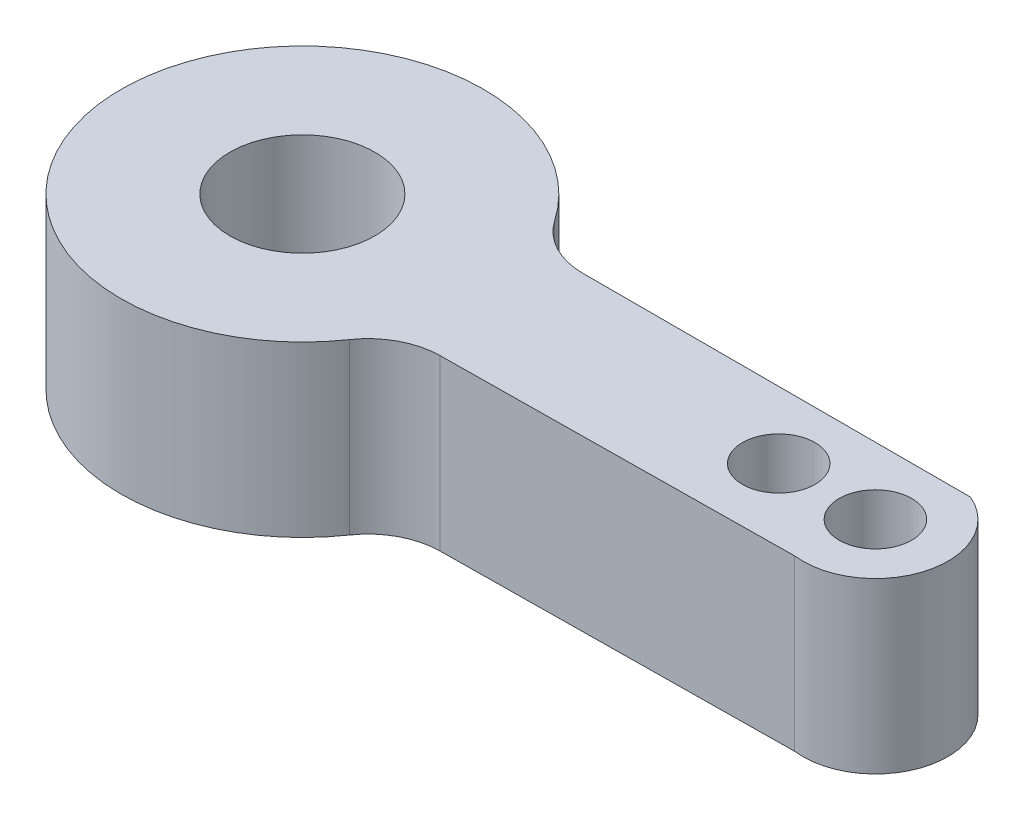
ISO-10303-21;
HEADER;
FILE_DESCRIPTION(('STEP AP214'),'2;1');
FILE_NAME('part.step','',(''),(''),'','','');
FILE_SCHEMA(('AUTOMOTIVE_DESIGN { 1 0 10303 214 1 1 1 1 }'));
ENDSEC;
DATA;
#1=APPLICATION_CONTEXT('core data for automotive mechanical design processes');
#2=APPLICATION_PROTOCOL_DEFINITION('international standard','automotive_design',2000,#1);
#3=PRODUCT_CONTEXT('',#1,'mechanical');
#4=PRODUCT('Part','Part','',(#3));
#5=PRODUCT_RELATED_PRODUCT_CATEGORY('part','',(#4));
#6=PRODUCT_DEFINITION_FORMATION('','',#4);
#7=PRODUCT_DEFINITION_CONTEXT('part definition',#1,'design');
#8=PRODUCT_DEFINITION('design','',#6,#7);
#9=PRODUCT_DEFINITION_SHAPE('','',#8);
#10=(LENGTH_UNIT() NAMED_UNIT(*) SI_UNIT(.MILLI.,.METRE.));
#11=(NAMED_UNIT(*) PLANE_ANGLE_UNIT() SI_UNIT($,.RADIAN.));
#12=(NAMED_UNIT(*) SI_UNIT($,.STERADIAN.) SOLID_ANGLE_UNIT());
#13=UNCERTAINTY_MEASURE_WITH_UNIT(LENGTH_MEASURE(1.E-05),#10,'distance_accuracy_value','');
#14=(GEOMETRIC_REPRESENTATION_CONTEXT(3) GLOBAL_UNCERTAINTY_ASSIGNED_CONTEXT((#13)) GLOBAL_UNIT_ASSIGNED_CONTEXT((#10,
#11,#12)) REPRESENTATION_CONTEXT('',''));
#15=CARTESIAN_POINT('',(0.,0.,0.));
#16=DIRECTION('',(0.,0.,1.));
#17=DIRECTION('',(1.,0.,0.));
#18=AXIS2_PLACEMENT_3D('',#15,#16,#17);
#19=CARTESIAN_POINT('',(0.,7.,0.));
#20=DIRECTION('',(0.,-1.,0.));
#21=DIRECTION('',(0.,0.,-1.));
#22=AXIS2_PLACEMENT_3D('',#19,#20,#21);
#23=PLANE('',#22);
#24=DIRECTION('',(-1.,0.,0.));
#25=VECTOR('',#24,1.);
#26=CARTESIAN_POINT('',(6.89102231975947,7.,-2.96037352180037));
#27=LINE('',#26,#25);
#28=CARTESIAN_POINT('',(24.6694144597538,7.,-2.96037352180037));
#29=VERTEX_POINT('',#28);
#30=CARTESIAN_POINT('',(8.64430144549697,7.,-2.96037352180037));
#31=VERTEX_POINT('',#30);
#32=EDGE_CURVE('E114',#29,#31,#27,.T.);
#33=ORIENTED_EDGE('',*,*,#32,.T.);
#34=CARTESIAN_POINT('',(8.64430144549697,7.,-5.96037352180037));
#35=DIRECTION('',(0.,-1.,0.));
#36=DIRECTION('',(0.,0.,-1.));
#37=AXIS2_PLACEMENT_3D('',#34,#35,#36);
#38=CIRCLE('',#37,3.);
#39=CARTESIAN_POINT('',(6.17450103249783,7.,-4.25740965842883));
#40=VERTEX_POINT('',#39);
#41=EDGE_CURVE('E11',#31,#40,#38,.T.);
#42=ORIENTED_EDGE('',*,*,#41,.T.);
#43=CARTESIAN_POINT('',(0.,7.,0.));
#44=DIRECTION('',(0.,1.,0.));
#45=DIRECTION('',(0.,0.,-1.));
#46=AXIS2_PLACEMENT_3D('',#43,#44,#45);
#47=CIRCLE('',#46,7.49999999999999);
#48=CARTESIAN_POINT('',(6.18399734642069,7.,4.24360422512064));
#49=VERTEX_POINT('',#48);
#50=EDGE_CURVE('E100',#40,#49,#47,.T.);
#51=ORIENTED_EDGE('',*,*,#50,.T.);
#52=CARTESIAN_POINT('',(8.65759628498897,7.,5.9410459151689));
#53=DIRECTION('',(0.,-1.,0.));
#54=DIRECTION('',(0.,0.,-1.));
#55=AXIS2_PLACEMENT_3D('',#52,#53,#54);
#56=CIRCLE('',#55,3.);
#57=CARTESIAN_POINT('',(8.62446541754517,7.,2.94122886314349));
#58=VERTEX_POINT('',#57);
#59=EDGE_CURVE('E96',#49,#58,#56,.T.);
#60=ORIENTED_EDGE('',*,*,#59,.T.);
#61=DIRECTION('',(0.999939017341803,0.,-0.0110436224812638));
#62=VECTOR('',#61,1.);
#63=CARTESIAN_POINT('',(6.89102231975947,7.,2.96037352180037));
#64=LINE('',#63,#62);
#65=CARTESIAN_POINT('',(23.1420853546382,7.,2.78089197146191));
#66=VERTEX_POINT('',#65);
#67=EDGE_CURVE('E88',#58,#66,#64,.T.);
#68=ORIENTED_EDGE('',*,*,#67,.T.);
#69=CARTESIAN_POINT('',(23.5,7.,-0.197681026910896));
#70=DIRECTION('',(0.,1.,0.));
#71=DIRECTION('',(0.,0.,-1.));
#72=AXIS2_PLACEMENT_3D('',#69,#70,#71);
#73=CIRCLE('',#72,3.);
#74=EDGE_CURVE('E92',#66,#29,#73,.T.);
#75=ORIENTED_EDGE('',*,*,#74,.T.);
#76=EDGE_LOOP('',(#33,#42,#51,#60,#68,#75));
#77=FACE_BOUND('',#76,.T.);
#78=CARTESIAN_POINT('',(23.5,7.,-0.197681026910896));
#79=DIRECTION('',(0.,1.,0.));
#80=DIRECTION('',(0.,0.,1.));
#81=AXIS2_PLACEMENT_3D('',#78,#79,#80);
#82=CIRCLE('',#81,1.5);
#83=CARTESIAN_POINT('',(23.5,7.,1.3023189730891));
#84=VERTEX_POINT('',#83);
#85=EDGE_CURVE('E122',#84,#84,#82,.T.);
#86=ORIENTED_EDGE('',*,*,#85,.F.);
#87=EDGE_LOOP('',(#86));
#88=FACE_BOUND('',#87,.T.);
#89=CARTESIAN_POINT('',(19.5,7.,-0.197681026910895));
#90=DIRECTION('',(0.,1.,0.));
#91=DIRECTION('',(0.,0.,1.));
#92=AXIS2_PLACEMENT_3D('',#89,#90,#91);
#93=CIRCLE('',#92,1.5);
#94=CARTESIAN_POINT('',(19.5,7.,1.30231897308911));
#95=VERTEX_POINT('',#94);
#96=EDGE_CURVE('E251',#95,#95,#93,.T.);
#97=ORIENTED_EDGE('',*,*,#96,.F.);
#98=EDGE_LOOP('',(#97));
#99=FACE_BOUND('',#98,.T.);
#100=CARTESIAN_POINT('',(0.,7.,0.));
#101=DIRECTION('',(0.,1.,0.));
#102=DIRECTION('',(0.,0.,1.));
#103=AXIS2_PLACEMENT_3D('',#100,#101,#102);
#104=CIRCLE('',#103,3.);
#105=CARTESIAN_POINT('',(0.,7.,3.));
#106=VERTEX_POINT('',#105);
#107=EDGE_CURVE('E255',#106,#106,#104,.T.);
#108=ORIENTED_EDGE('',*,*,#107,.F.);
#109=EDGE_LOOP('',(#108));
#110=FACE_BOUND('',#109,.T.);
#111=ADVANCED_FACE('F36',(#77,#88,#99,#110),#23,.F.);
#112=CARTESIAN_POINT('',(0.,0.,0.));
#113=DIRECTION('',(0.,-1.,0.));
#114=DIRECTION('',(0.,0.,-1.));
#115=AXIS2_PLACEMENT_3D('',#112,#113,#114);
#116=PLANE('',#115);
#117=CARTESIAN_POINT('',(19.5,0.,-0.197681026910895));
#118=DIRECTION('',(0.,1.,0.));
#119=DIRECTION('',(0.,0.,1.));
#120=AXIS2_PLACEMENT_3D('',#117,#118,#119);
#121=CIRCLE('',#120,1.5);
#122=CARTESIAN_POINT('',(19.5,0.,1.30231897308911));
#123=VERTEX_POINT('',#122);
#124=EDGE_CURVE('E254',#123,#123,#121,.T.);
#125=ORIENTED_EDGE('',*,*,#124,.T.);
#126=EDGE_LOOP('',(#125));
#127=FACE_BOUND('',#126,.T.);
#128=CARTESIAN_POINT('',(0.,0.,0.));
#129=DIRECTION('',(0.,1.,0.));
#130=DIRECTION('',(0.,0.,1.));
#131=AXIS2_PLACEMENT_3D('',#128,#129,#130);
#132=CIRCLE('',#131,7.49999999999999);
#133=CARTESIAN_POINT('',(6.17450103249783,0.,-4.25740965842883));
#134=VERTEX_POINT('',#133);
#135=CARTESIAN_POINT('',(6.18399734642069,0.,4.24360422512064));
#136=VERTEX_POINT('',#135);
#137=EDGE_CURVE('E119',#134,#136,#132,.T.);
#138=ORIENTED_EDGE('',*,*,#137,.F.);
#139=CARTESIAN_POINT('',(8.64430144549697,0.,-5.96037352180037));
#140=DIRECTION('',(0.,-1.,0.));
#141=DIRECTION('',(0.,0.,-1.));
#142=AXIS2_PLACEMENT_3D('',#139,#140,#141);
#143=CIRCLE('',#142,3.);
#144=CARTESIAN_POINT('',(8.64430144549697,0.,-2.96037352180037));
#145=VERTEX_POINT('',#144);
#146=EDGE_CURVE('E44',#134,#145,#143,.F.);
#147=ORIENTED_EDGE('',*,*,#146,.T.);
#148=DIRECTION('',(-1.,0.,0.));
#149=VECTOR('',#148,1.);
#150=CARTESIAN_POINT('',(6.89102231975947,0.,-2.96037352180037));
#151=LINE('',#150,#149);
#152=CARTESIAN_POINT('',(24.6694144597538,0.,-2.96037352180037));
#153=VERTEX_POINT('',#152);
#154=EDGE_CURVE('E126',#153,#145,#151,.T.);
#155=ORIENTED_EDGE('',*,*,#154,.F.);
#156=CARTESIAN_POINT('',(23.5,0.,-0.197681026910896));
#157=DIRECTION('',(0.,1.,0.));
#158=DIRECTION('',(0.,0.,-1.));
#159=AXIS2_PLACEMENT_3D('',#156,#157,#158);
#160=CIRCLE('',#159,3.);
#161=CARTESIAN_POINT('',(23.1420853546382,0.,2.78089197146191));
#162=VERTEX_POINT('',#161);
#163=EDGE_CURVE('E124',#162,#153,#160,.T.);
#164=ORIENTED_EDGE('',*,*,#163,.F.);
#165=DIRECTION('',(0.999939017341803,0.,-0.0110436224812638));
#166=VECTOR('',#165,1.);
#167=CARTESIAN_POINT('',(6.89102231975947,0.,2.96037352180037));
#168=LINE('',#167,#166);
#169=CARTESIAN_POINT('',(8.62446541754517,0.,2.94122886314349));
#170=VERTEX_POINT('',#169);
#171=EDGE_CURVE('E106',#170,#162,#168,.T.);
#172=ORIENTED_EDGE('',*,*,#171,.F.);
#173=CARTESIAN_POINT('',(8.65759628498897,0.,5.9410459151689));
#174=DIRECTION('',(0.,-1.,0.));
#175=DIRECTION('',(0.,0.,-1.));
#176=AXIS2_PLACEMENT_3D('',#173,#174,#175);
#177=CIRCLE('',#176,3.);
#178=EDGE_CURVE('E136',#170,#136,#177,.F.);
#179=ORIENTED_EDGE('',*,*,#178,.T.);
#180=EDGE_LOOP('',(#138,#147,#155,#164,#172,#179));
#181=FACE_BOUND('',#180,.T.);
#182=CARTESIAN_POINT('',(23.5,0.,-0.197681026910896));
#183=DIRECTION('',(0.,1.,0.));
#184=DIRECTION('',(0.,0.,1.));
#185=AXIS2_PLACEMENT_3D('',#182,#183,#184);
#186=CIRCLE('',#185,1.5);
#187=CARTESIAN_POINT('',(23.5,0.,1.3023189730891));
#188=VERTEX_POINT('',#187);
#189=EDGE_CURVE('E257',#188,#188,#186,.T.);
#190=ORIENTED_EDGE('',*,*,#189,.T.);
#191=EDGE_LOOP('',(#190));
#192=FACE_BOUND('',#191,.T.);
#193=CARTESIAN_POINT('',(0.,0.,0.));
#194=DIRECTION('',(0.,1.,0.));
#195=DIRECTION('',(0.,0.,1.));
#196=AXIS2_PLACEMENT_3D('',#193,#194,#195);
#197=CIRCLE('',#196,3.);
#198=CARTESIAN_POINT('',(0.,0.,3.));
#199=VERTEX_POINT('',#198);
#200=EDGE_CURVE('E260',#199,#199,#197,.T.);
#201=ORIENTED_EDGE('',*,*,#200,.T.);
#202=EDGE_LOOP('',(#201));
#203=FACE_BOUND('',#202,.T.);
#204=ADVANCED_FACE('F138',(#127,#181,#192,#203),#116,.T.);
#205=CARTESIAN_POINT('',(0.,7.,0.));
#206=DIRECTION('',(0.,-1.,0.));
#207=DIRECTION('',(0.,0.,-1.));
#208=AXIS2_PLACEMENT_3D('',#205,#206,#207);
#209=CYLINDRICAL_SURFACE('',#208,7.49999999999999);
#210=ORIENTED_EDGE('',*,*,#137,.T.);
#211=DIRECTION('',(0.,-1.,0.));
#212=VECTOR('',#211,1.);
#213=CARTESIAN_POINT('',(6.18399734642069,7.,4.24360422512064));
#214=LINE('',#213,#212);
#215=EDGE_CURVE('E133',#136,#49,#214,.F.);
#216=ORIENTED_EDGE('',*,*,#215,.T.);
#217=ORIENTED_EDGE('',*,*,#50,.F.);
#218=DIRECTION('',(0.,-1.,0.));
#219=VECTOR('',#218,1.);
#220=CARTESIAN_POINT('',(6.17450103249783,7.,-4.25740965842883));
#221=LINE('',#220,#219);
#222=EDGE_CURVE('E130',#40,#134,#221,.T.);
#223=ORIENTED_EDGE('',*,*,#222,.T.);
#224=EDGE_LOOP('',(#210,#216,#217,#223));
#225=FACE_BOUND('',#224,.T.);
#226=ADVANCED_FACE('F143',(#225),#209,.T.);
#227=CARTESIAN_POINT('',(6.89102231975947,7.,2.96037352180037));
#228=DIRECTION('',(-0.0110436224812638,0.,-0.999939017341803));
#229=DIRECTION('',(-0.999939017341803,0.,0.0110436224812638));
#230=AXIS2_PLACEMENT_3D('',#227,#228,#229);
#231=PLANE('',#230);
#232=ORIENTED_EDGE('',*,*,#67,.F.);
#233=DIRECTION('',(0.,1.,0.));
#234=VECTOR('',#233,1.);
#235=CARTESIAN_POINT('',(8.62446541754517,0.,2.94122886314349));
#236=LINE('',#235,#234);
#237=EDGE_CURVE('E109',#58,#170,#236,.F.);
#238=ORIENTED_EDGE('',*,*,#237,.T.);
#239=ORIENTED_EDGE('',*,*,#171,.T.);
#240=DIRECTION('',(0.,-1.,0.));
#241=VECTOR('',#240,1.);
#242=CARTESIAN_POINT('',(23.1420853546382,7.,2.78089197146191));
#243=LINE('',#242,#241);
#244=EDGE_CURVE('E103',#66,#162,#243,.T.);
#245=ORIENTED_EDGE('',*,*,#244,.F.);
#246=EDGE_LOOP('',(#232,#238,#239,#245));
#247=FACE_BOUND('',#246,.T.);
#248=ADVANCED_FACE('F104',(#247),#231,.F.);
#249=CARTESIAN_POINT('',(23.5,7.,-0.197681026910896));
#250=DIRECTION('',(0.,-1.,0.));
#251=DIRECTION('',(0.,0.,-1.));
#252=AXIS2_PLACEMENT_3D('',#249,#250,#251);
#253=CYLINDRICAL_SURFACE('',#252,3.);
#254=ORIENTED_EDGE('',*,*,#163,.T.);
#255=DIRECTION('',(0.,-1.,0.));
#256=VECTOR('',#255,1.);
#257=CARTESIAN_POINT('',(24.6694144597538,7.,-2.96037352180037));
#258=LINE('',#257,#256);
#259=EDGE_CURVE('E110',#29,#153,#258,.T.);
#260=ORIENTED_EDGE('',*,*,#259,.F.);
#261=ORIENTED_EDGE('',*,*,#74,.F.);
#262=ORIENTED_EDGE('',*,*,#244,.T.);
#263=EDGE_LOOP('',(#254,#260,#261,#262));
#264=FACE_BOUND('',#263,.T.);
#265=ADVANCED_FACE('F112',(#264),#253,.T.);
#266=CARTESIAN_POINT('',(6.89102231975947,7.,-2.96037352180037));
#267=DIRECTION('',(0.,0.,1.));
#268=DIRECTION('',(1.,0.,0.));
#269=AXIS2_PLACEMENT_3D('',#266,#267,#268);
#270=PLANE('',#269);
#271=ORIENTED_EDGE('',*,*,#154,.T.);
#272=DIRECTION('',(0.,1.,0.));
#273=VECTOR('',#272,1.);
#274=CARTESIAN_POINT('',(8.64430144549697,7.,-2.96037352180037));
#275=LINE('',#274,#273);
#276=EDGE_CURVE('E51',#145,#31,#275,.T.);
#277=ORIENTED_EDGE('',*,*,#276,.T.);
#278=ORIENTED_EDGE('',*,*,#32,.F.);
#279=ORIENTED_EDGE('',*,*,#259,.T.);
#280=EDGE_LOOP('',(#271,#277,#278,#279));
#281=FACE_BOUND('',#280,.T.);
#282=ADVANCED_FACE('F169',(#281),#270,.F.);
#283=CARTESIAN_POINT('',(23.5,7.,-0.197681026910896));
#284=DIRECTION('',(0.,-1.,0.));
#285=DIRECTION('',(0.,0.,-1.));
#286=AXIS2_PLACEMENT_3D('',#283,#284,#285);
#287=CYLINDRICAL_SURFACE('',#286,1.5);
#288=ORIENTED_EDGE('',*,*,#85,.T.);
#289=EDGE_LOOP('',(#288));
#290=FACE_BOUND('',#289,.T.);
#291=ORIENTED_EDGE('',*,*,#189,.F.);
#292=EDGE_LOOP('',(#291));
#293=FACE_BOUND('',#292,.T.);
#294=ADVANCED_FACE('F166',(#290,#293),#287,.F.);
#295=CARTESIAN_POINT('',(19.5,7.,-0.197681026910895));
#296=DIRECTION('',(0.,-1.,0.));
#297=DIRECTION('',(0.,0.,-1.));
#298=AXIS2_PLACEMENT_3D('',#295,#296,#297);
#299=CYLINDRICAL_SURFACE('',#298,1.5);
#300=ORIENTED_EDGE('',*,*,#96,.T.);
#301=EDGE_LOOP('',(#300));
#302=FACE_BOUND('',#301,.T.);
#303=ORIENTED_EDGE('',*,*,#124,.F.);
#304=EDGE_LOOP('',(#303));
#305=FACE_BOUND('',#304,.T.);
#306=ADVANCED_FACE('F154',(#302,#305),#299,.F.);
#307=CARTESIAN_POINT('',(0.,7.,0.));
#308=DIRECTION('',(0.,-1.,0.));
#309=DIRECTION('',(0.,0.,-1.));
#310=AXIS2_PLACEMENT_3D('',#307,#308,#309);
#311=CYLINDRICAL_SURFACE('',#310,3.);
#312=ORIENTED_EDGE('',*,*,#107,.T.);
#313=EDGE_LOOP('',(#312));
#314=FACE_BOUND('',#313,.T.);
#315=ORIENTED_EDGE('',*,*,#200,.F.);
#316=EDGE_LOOP('',(#315));
#317=FACE_BOUND('',#316,.T.);
#318=ADVANCED_FACE('F148',(#314,#317),#311,.F.);
#319=CARTESIAN_POINT('',(8.65759628498897,7.,5.9410459151689));
#320=DIRECTION('',(0.,-1.,0.));
#321=DIRECTION('',(0.,0.,-1.));
#322=AXIS2_PLACEMENT_3D('',#319,#320,#321);
#323=CYLINDRICAL_SURFACE('',#322,3.);
#324=ORIENTED_EDGE('',*,*,#59,.F.);
#325=ORIENTED_EDGE('',*,*,#215,.F.);
#326=ORIENTED_EDGE('',*,*,#178,.F.);
#327=ORIENTED_EDGE('',*,*,#237,.F.);
#328=EDGE_LOOP('',(#324,#325,#326,#327));
#329=FACE_BOUND('',#328,.T.);
#330=ADVANCED_FACE('F146',(#329),#323,.F.);
#331=CARTESIAN_POINT('',(8.64430144549697,7.,-5.96037352180037));
#332=DIRECTION('',(0.,-1.,0.));
#333=DIRECTION('',(0.,0.,-1.));
#334=AXIS2_PLACEMENT_3D('',#331,#332,#333);
#335=CYLINDRICAL_SURFACE('',#334,3.);
#336=ORIENTED_EDGE('',*,*,#41,.F.);
#337=ORIENTED_EDGE('',*,*,#276,.F.);
#338=ORIENTED_EDGE('',*,*,#146,.F.);
#339=ORIENTED_EDGE('',*,*,#222,.F.);
#340=EDGE_LOOP('',(#336,#337,#338,#339));
#341=FACE_BOUND('',#340,.T.);
#342=ADVANCED_FACE('F38',(#341),#335,.F.);
#343=CLOSED_SHELL('',(#111,#204,#226,#248,#265,#282,#294,#306,#318,#330,#342));
#344=MANIFOLD_SOLID_BREP('B2',#343);
#345=ADVANCED_BREP_SHAPE_REPRESENTATION('',(#18,#344),#14);
#346=SHAPE_DEFINITION_REPRESENTATION(#9,#345);
ENDSEC;
END-ISO-10303-21;
